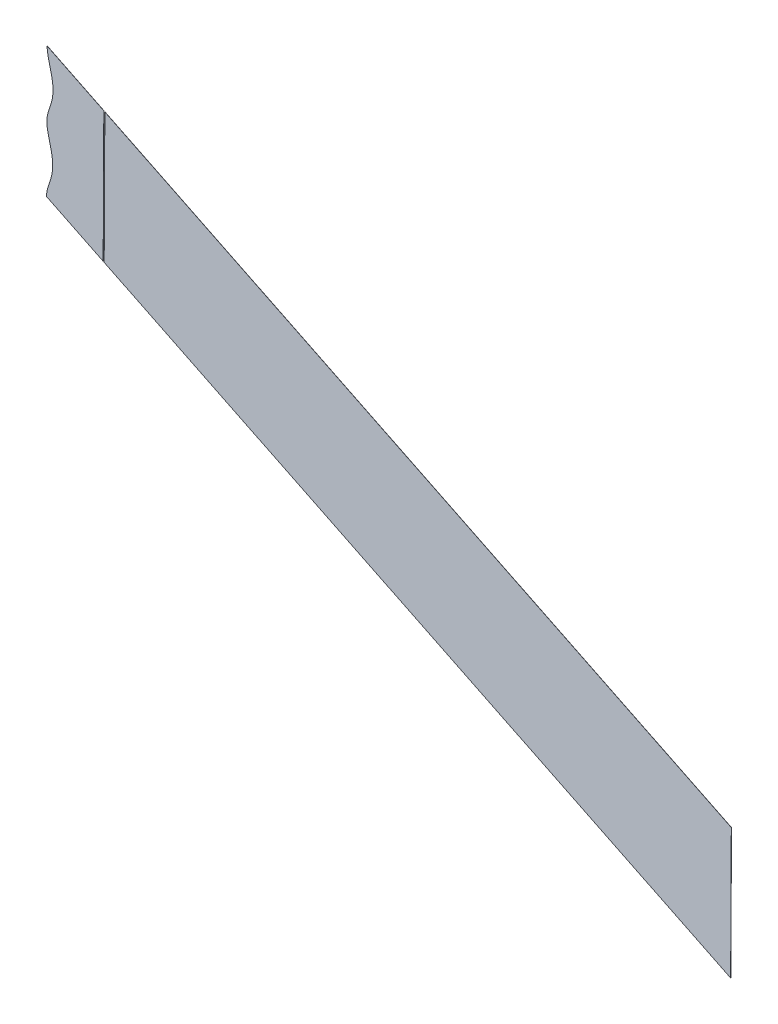
ISO-10303-21;
HEADER;
FILE_DESCRIPTION(('STEP AP214'),'2;1');
FILE_NAME('part.step','',(''),(''),'','','');
FILE_SCHEMA(('AUTOMOTIVE_DESIGN { 1 0 10303 214 1 1 1 1 }'));
ENDSEC;
DATA;
#1=APPLICATION_CONTEXT('core data for automotive mechanical design processes');
#2=APPLICATION_PROTOCOL_DEFINITION('international standard','automotive_design',2000,#1);
#3=PRODUCT_CONTEXT('',#1,'mechanical');
#4=PRODUCT('Part','Part','',(#3));
#5=PRODUCT_RELATED_PRODUCT_CATEGORY('part','',(#4));
#6=PRODUCT_DEFINITION_FORMATION('','',#4);
#7=PRODUCT_DEFINITION_CONTEXT('part definition',#1,'design');
#8=PRODUCT_DEFINITION('design','',#6,#7);
#9=PRODUCT_DEFINITION_SHAPE('','',#8);
#10=(LENGTH_UNIT() NAMED_UNIT(*) SI_UNIT(.MILLI.,.METRE.));
#11=(NAMED_UNIT(*) PLANE_ANGLE_UNIT() SI_UNIT($,.RADIAN.));
#12=(NAMED_UNIT(*) SI_UNIT($,.STERADIAN.) SOLID_ANGLE_UNIT());
#13=UNCERTAINTY_MEASURE_WITH_UNIT(LENGTH_MEASURE(1.E-05),#10,'distance_accuracy_value','');
#14=(GEOMETRIC_REPRESENTATION_CONTEXT(3) GLOBAL_UNCERTAINTY_ASSIGNED_CONTEXT((#13)) GLOBAL_UNIT_ASSIGNED_CONTEXT((#10,
#11,#12)) REPRESENTATION_CONTEXT('',''));
#15=CARTESIAN_POINT('',(0.,0.,0.));
#16=DIRECTION('',(0.,0.,1.));
#17=DIRECTION('',(1.,0.,0.));
#18=AXIS2_PLACEMENT_3D('',#15,#16,#17);
#19=CARTESIAN_POINT('',(628.032804993506,79.4316688549309,219.363239706042));
#20=DIRECTION('',(-0.00123855980853146,-0.999992126449225,0.00377001447705827));
#21=DIRECTION('',(0.,-0.00377001736872001,-0.999992893459268));
#22=AXIS2_PLACEMENT_3D('',#19,#20,#21);
#23=PLANE('',#22);
#24=DIRECTION('',(-0.950043648219437,0.,-0.312117071750175));
#25=VECTOR('',#24,1.);
#26=CARTESIAN_POINT('',(628.032804993506,79.4316688549309,219.363239706042));
#27=LINE('',#26,#25);
#28=CARTESIAN_POINT('',(58.0066160618442,79.4316688549313,32.0929966559377));
#29=VERTEX_POINT('',#28);
#30=CARTESIAN_POINT('',(6.54741442095069,79.4316688549331,15.187146739611));
#31=VERTEX_POINT('',#30);
#32=EDGE_CURVE('E94',#29,#31,#27,.T.);
#33=ORIENTED_EDGE('',*,*,#32,.F.);
#34=DIRECTION('',(-0.312114614280563,0.00396825396825084,0.950036168002534));
#35=VECTOR('',#34,1.);
#36=CARTESIAN_POINT('',(61.1277622046498,79.3919863152488,22.5926349759124));
#37=LINE('',#36,#35);
#38=CARTESIAN_POINT('',(58.0378275232734,79.4312720295342,31.9979930391378));
#39=VERTEX_POINT('',#38);
#40=EDGE_CURVE('E58',#39,#29,#37,.T.);
#41=ORIENTED_EDGE('',*,*,#40,.F.);
#42=DIRECTION('',(-0.950043648219437,0.,-0.312117071750175));
#43=VECTOR('',#42,1.);
#44=CARTESIAN_POINT('',(628.064016454934,79.431272029534,219.268236089242));
#45=LINE('',#44,#43);
#46=CARTESIAN_POINT('',(6.57862588237879,79.4312720295362,15.0921431228107));
#47=VERTEX_POINT('',#46);
#48=EDGE_CURVE('E52',#39,#47,#45,.T.);
#49=ORIENTED_EDGE('',*,*,#48,.T.);
#50=DIRECTION('',(0.312114614280564,-0.00396825396825083,-0.950036168002534));
#51=VECTOR('',#50,1.);
#52=CARTESIAN_POINT('',(6.54741442095069,79.4316688549331,15.187146739611));
#53=LINE('',#52,#51);
#54=EDGE_CURVE('E103',#31,#47,#53,.T.);
#55=ORIENTED_EDGE('',*,*,#54,.F.);
#56=EDGE_LOOP('',(#33,#41,#49,#55));
#57=FACE_BOUND('',#56,.T.);
#58=ADVANCED_FACE('F49',(#57),#23,.F.);
#59=CARTESIAN_POINT('',(627.934485766299,0.0503968253967799,219.662510607126));
#60=DIRECTION('',(-0.00123855980853147,-0.999992126449225,0.00377001447705827));
#61=DIRECTION('',(0.,-0.00377001736872,-0.999992893459268));
#62=AXIS2_PLACEMENT_3D('',#59,#60,#61);
#63=PLANE('',#62);
#64=DIRECTION('',(0.312114614280563,-0.00396825396825083,-0.950036168002534));
#65=VECTOR('',#64,1.);
#66=CARTESIAN_POINT('',(57.9082968346368,0.0503968253967868,32.3922675570206));
#67=LINE('',#66,#65);
#68=CARTESIAN_POINT('',(57.9082968346367,0.0503968253973419,32.3922675570209));
#69=VERTEX_POINT('',#68);
#70=CARTESIAN_POINT('',(57.939508296064,0.0499999999999182,32.2972639402202));
#71=VERTEX_POINT('',#70);
#72=EDGE_CURVE('E77',#69,#71,#67,.T.);
#73=ORIENTED_EDGE('',*,*,#72,.F.);
#74=DIRECTION('',(-0.950043648219437,0.,-0.312117071750175));
#75=VECTOR('',#74,1.);
#76=CARTESIAN_POINT('',(627.934485766299,0.0503968253967799,219.662510607126));
#77=LINE('',#76,#75);
#78=CARTESIAN_POINT('',(6.44909519374426,0.0503968253975917,15.4864176406947));
#79=VERTEX_POINT('',#78);
#80=EDGE_CURVE('E88',#69,#79,#77,.T.);
#81=ORIENTED_EDGE('',*,*,#80,.T.);
#82=DIRECTION('',(0.312114614280564,-0.00396825396825083,-0.950036168002534));
#83=VECTOR('',#82,1.);
#84=CARTESIAN_POINT('',(6.44909519374426,0.0503968253975917,15.4864176406947));
#85=LINE('',#84,#83);
#86=CARTESIAN_POINT('',(6.48030665517235,0.0500000000007716,15.3914140238945));
#87=VERTEX_POINT('',#86);
#88=EDGE_CURVE('E100',#79,#87,#85,.T.);
#89=ORIENTED_EDGE('',*,*,#88,.T.);
#90=DIRECTION('',(-0.950043648219437,0.,-0.312117071750175));
#91=VECTOR('',#90,1.);
#92=CARTESIAN_POINT('',(627.965697227727,0.0499999999999529,219.567506990325));
#93=LINE('',#92,#91);
#94=EDGE_CURVE('E112',#71,#87,#93,.T.);
#95=ORIENTED_EDGE('',*,*,#94,.F.);
#96=EDGE_LOOP('',(#73,#81,#89,#95));
#97=FACE_BOUND('',#96,.T.);
#98=ADVANCED_FACE('F134',(#97),#63,.T.);
#99=CARTESIAN_POINT('',(-6216.50703644315,-6541.54901748097,-2001.61239335012));
#100=DIRECTION('',(-0.312114614280563,0.00396825396825086,0.950036168002534));
#101=DIRECTION('',(0.950043648219437,0.,0.312117071750175));
#102=AXIS2_PLACEMENT_3D('',#99,#100,#101);
#103=PLANE('',#102);
#104=DIRECTION('',(-0.00123855980853318,-0.999992126449225,0.0037700144770577));
#105=VECTOR('',#104,1.);
#106=CARTESIAN_POINT('',(58.0066160618442,79.4316688549313,32.0929966559377));
#107=LINE('',#106,#105);
#108=EDGE_CURVE('E14',#29,#69,#107,.T.);
#109=ORIENTED_EDGE('',*,*,#108,.F.);
#110=ORIENTED_EDGE('',*,*,#32,.T.);
#111=CARTESIAN_POINT('',(6.44909519374426,0.0503968253975917,15.4864176406947));
#112=CARTESIAN_POINT('',(6.45267553206141,0.694877688035618,15.4849019217397));
#113=CARTESIAN_POINT('',(6.60024022614708,1.9723408909303,15.5280453309405));
#114=CARTESIAN_POINT('',(6.87011388118269,3.23074813002961,15.6114504000257));
#115=CARTESIAN_POINT('',(7.23726659138035,4.46588351341087,15.7269116838521));
#116=CARTESIAN_POINT('',(7.66921390288411,5.66719320489578,15.8638011739042));
#117=CARTESIAN_POINT('',(7.9284335005636,6.31243220401629,15.9462672474745));
#118=CARTESIAN_POINT('',(8.13853415182142,6.83540629681218,16.0131070077357));
#119=CARTESIAN_POINT('',(8.42407153259589,7.50652937080194,16.1041111248142));
#120=CARTESIAN_POINT('',(8.57799106491913,7.86829969103337,16.1531670876521));
#121=CARTESIAN_POINT('',(9.26304759597968,9.4531039534343,16.3716085071884));
#122=CARTESIAN_POINT('',(9.44205256667302,9.87519417333377,16.4286538155854));
#123=CARTESIAN_POINT('',(9.71898902647328,10.5282049291955,16.5169079333037));
#124=CARTESIAN_POINT('',(9.93592279887773,11.0670297861327,16.5859263654752));
#125=CARTESIAN_POINT('',(10.192452296035,11.7042033717614,16.6675423513281));
#126=CARTESIAN_POINT('',(10.6360364196736,12.9058616158624,16.808253417977));
#127=CARTESIAN_POINT('',(11.0333203984229,14.1263000971839,16.933675091334));
#128=CARTESIAN_POINT('',(11.5535280437057,16.0329560927653,17.0966144809557));
#129=CARTESIAN_POINT('',(11.9235284408852,18.5707403415976,17.2075702133621));
#130=CARTESIAN_POINT('',(11.92925785254,21.1367631770945,17.1987343421884));
#131=CARTESIAN_POINT('',(11.5691639936483,23.6805202076458,17.0698078508305));
#132=CARTESIAN_POINT('',(11.0534967922278,25.5952291849709,16.8923984775429));
#133=CARTESIAN_POINT('',(10.6573095508077,26.824097076742,16.7571064831371));
#134=CARTESIAN_POINT('',(10.2156455451671,28.0292184592226,16.6069732321367));
#135=CARTESIAN_POINT('',(9.96208485787392,28.6633159174115,16.5210225508718));
#136=CARTESIAN_POINT('',(9.74603608978686,29.2036046197011,16.4477874646219));
#137=CARTESIAN_POINT('',(9.47021850443985,29.8579581546748,16.3544401340031));
#138=CARTESIAN_POINT('',(9.29111869109595,30.282857081357,16.2938258353576));
#139=CARTESIAN_POINT('',(8.60917590746835,31.8695493885859,16.0631601888289));
#140=CARTESIAN_POINT('',(8.45681313155405,32.2297046141754,16.0116002187058));
#141=CARTESIAN_POINT('',(8.17429891387672,32.8975118997124,15.9159966532322));
#142=CARTESIAN_POINT('',(7.96635019813902,33.4179554179033,15.8455055629825));
#143=CARTESIAN_POINT('',(7.70607294634118,34.069364146973,15.7572759858906));
#144=CARTESIAN_POINT('',(7.27475668276162,35.2772033716272,15.6105309179324));
#145=CARTESIAN_POINT('',(6.91128682377729,36.5111062484236,15.4859665078469));
#146=CARTESIAN_POINT('',(6.64303639610869,37.775718600764,15.3925561886019));
#147=CARTESIAN_POINT('',(6.49941091916284,39.0603275080433,15.3400052790538));
#148=CARTESIAN_POINT('',(6.49689689571542,40.3534873472807,15.333777884433));
#149=CARTESIAN_POINT('',(6.63728269784991,41.6406765536393,15.3745221930306));
#150=CARTESIAN_POINT('',(6.90251906480599,42.906314470786,15.4563735754276));
#151=CARTESIAN_POINT('',(7.26613489723288,44.1452542988155,15.5706570006827));
#152=CARTESIAN_POINT('',(7.69631108316671,45.3502898567478,15.7069490615239));
#153=CARTESIAN_POINT('',(7.95466786258342,45.9959341424583,15.7891299812454));
#154=CARTESIAN_POINT('',(8.16494264649847,46.5214195311917,15.8560164596091));
#155=CARTESIAN_POINT('',(8.44915103983868,47.1905713804442,15.946592199228));
#156=CARTESIAN_POINT('',(8.612261692587,47.5746057632301,15.9985747175439));
#157=CARTESIAN_POINT('',(9.29589160006905,49.1559967256257,16.2165617067739));
#158=CARTESIAN_POINT('',(9.46872575901431,49.5629009447927,16.2716431545483));
#159=CARTESIAN_POINT('',(9.74680870427758,50.2175928436464,16.3602669041581));
#160=CARTESIAN_POINT('',(9.96356507603613,50.754345866497,16.4292357089868));
#161=CARTESIAN_POINT('',(10.2214357470817,51.3929100806252,16.5112865010266));
#162=CARTESIAN_POINT('',(10.6673965631501,52.5955831356504,16.6527741417035));
#163=CARTESIAN_POINT('',(11.0672594136796,53.8164618075883,16.7790412110672));
#164=CARTESIAN_POINT('',(11.5923813775179,55.7249177301913,16.9435875795851));
#165=CARTESIAN_POINT('',(11.9691216230043,58.2640703057254,17.0567518334751));
#166=CARTESIAN_POINT('',(11.9817838927626,60.8323424275199,17.050184213412));
#167=CARTESIAN_POINT('',(11.6270393814345,63.3803508577507,16.9229973809996));
#168=CARTESIAN_POINT('',(11.1141723206686,65.297458586134,16.7464979161931));
#169=CARTESIAN_POINT('',(10.7192683987107,66.5281222026935,16.6116200290395));
#170=CARTESIAN_POINT('',(10.2781490420433,67.7355504513362,16.4616560754604));
#171=CARTESIAN_POINT('',(10.0248543775788,68.3702368496085,16.3757903304869));
#172=CARTESIAN_POINT('',(9.80864743092824,68.9119916810477,16.3024971540126));
#173=CARTESIAN_POINT('',(9.53339235459205,69.5656754761143,16.2093374214951));
#174=CARTESIAN_POINT('',(9.35087492870928,69.9991231901554,16.147564629504));
#175=CARTESIAN_POINT('',(8.66516405089601,71.5947010183327,15.9156239396582));
#176=CARTESIAN_POINT('',(8.51857498823377,71.9409094071691,15.8660190581275));
#177=CARTESIAN_POINT('',(8.23517510011873,72.6102323217107,15.7701181933537));
#178=CARTESIAN_POINT('',(8.02725072122673,73.1295895258735,15.6996396359485));
#179=CARTESIAN_POINT('',(7.76633546278482,73.7813082895385,15.6111991600501));
#180=CARTESIAN_POINT('',(7.33320392970049,74.9899674721395,15.4638542981452));
#181=CARTESIAN_POINT('',(6.96739270919833,76.2251137009973,15.3385154890335));
#182=CARTESIAN_POINT('',(6.69638172993881,77.4912336193963,15.2441919509771));
#183=CARTESIAN_POINT('',(6.54941246886365,78.7825820055342,15.1905143602628));
#184=CARTESIAN_POINT('',(6.54741442095069,79.4316688549331,15.187146739611));
#185=B_SPLINE_CURVE_WITH_KNOTS('',2,(#111,#112,#113,#114,#115,#116,#117,#118,#119,#120,#121,
#122,#123,#124,#125,#126,#127,#128,#129,#130,#131,#132,#133,#134,#135,#136,#137,#138,#139,#140,
#141,#142,#143,#144,#145,#146,#147,#148,#149,#150,#151,#152,#153,#154,#155,#156,#157,#158,#159,
#160,#161,#162,#163,#164,#165,#166,#167,#168,#169,#170,#171,#172,#173,#174,#175,#176,#177,#178,
#179,#180,#181,#182,#183,#184),.UNSPECIFIED.,.F.,.F.,(3,1,1,1,1,2,2,1,2,2,1,1,1,1,1,1,1,1,1,2,2,
1,2,2,1,1,1,1,1,1,1,1,1,2,2,1,2,2,1,1,1,1,1,1,1,1,1,2,2,1,2,2,1,1,1,1,3),(0.,0.015625,0.03125,
0.046875,0.0625,0.078125,0.09375,0.109375,0.125,0.140625,0.15625,0.171875,0.1875,0.21875,0.25,
0.28125,0.3125,0.328125,0.34375,0.359375,0.375,0.390625,0.40625,0.421875,0.4375,0.453125,
0.46875,0.484375,0.5,0.515625,0.53125,0.546875,0.5625,0.578125,0.59375,0.609375,0.625,0.640625,
0.65625,0.671875,0.6875,0.71875,0.75,0.78125,0.8125,0.828125,0.84375,0.859375,0.875,0.890625,
0.90625,0.921875,0.9375,0.953125,0.96875,0.984375,1.),.UNSPECIFIED.);
#186=EDGE_CURVE('E98',#79,#31,#185,.T.);
#187=ORIENTED_EDGE('',*,*,#186,.F.);
#188=ORIENTED_EDGE('',*,*,#80,.F.);
#189=EDGE_LOOP('',(#109,#110,#187,#188));
#190=FACE_BOUND('',#189,.T.);
#191=ADVANCED_FACE('F96',(#190),#103,.T.);
#192=CARTESIAN_POINT('',(-6216.47582498172,-6541.54941430637,-2001.70739696692));
#193=DIRECTION('',(-0.312114614280563,0.00396825396825086,0.950036168002534));
#194=DIRECTION('',(0.950043648219437,0.,0.312117071750175));
#195=AXIS2_PLACEMENT_3D('',#192,#193,#194);
#196=PLANE('',#195);
#197=ORIENTED_EDGE('',*,*,#48,.F.);
#198=DIRECTION('',(-0.00123855980853319,-0.999992126449225,0.00377001447705774));
#199=VECTOR('',#198,1.);
#200=CARTESIAN_POINT('',(49.8372823846927,-6541.54941430638,56.9593826137113));
#201=LINE('',#200,#199);
#202=EDGE_CURVE('E73',#39,#71,#201,.T.);
#203=ORIENTED_EDGE('',*,*,#202,.T.);
#204=ORIENTED_EDGE('',*,*,#94,.T.);
#205=CARTESIAN_POINT('',(6.48030665517235,0.0500000000007716,15.3914140238945));
#206=CARTESIAN_POINT('',(6.4838869934894,0.694480862638798,15.3898983049394));
#207=CARTESIAN_POINT('',(6.63145168757517,1.97194406553347,15.4330417141402));
#208=CARTESIAN_POINT('',(6.90132534261073,3.23035130463279,15.5164467832254));
#209=CARTESIAN_POINT('',(7.26847805280839,4.46548668801405,15.6319080670518));
#210=CARTESIAN_POINT('',(7.7004253643122,5.66679637949896,15.7687975571039));
#211=CARTESIAN_POINT('',(7.9596449619917,6.31203537861947,15.8512636306743));
#212=CARTESIAN_POINT('',(8.16974561324946,6.83500947141535,15.9181033909355));
#213=CARTESIAN_POINT('',(8.45528299402387,7.50613254540511,16.0091075080139));
#214=CARTESIAN_POINT('',(8.60920252634717,7.86790286563654,16.0581634708518));
#215=CARTESIAN_POINT('',(9.29425905740772,9.45270712803747,16.2766048903882));
#216=CARTESIAN_POINT('',(9.473264028101,9.87479734793695,16.3336501987851));
#217=CARTESIAN_POINT('',(9.75020048790132,10.5278081037987,16.4219043165034));
#218=CARTESIAN_POINT('',(9.96713426030577,11.0666329607358,16.490922748675));
#219=CARTESIAN_POINT('',(10.2236637574631,11.7038065463646,16.5725387345279));
#220=CARTESIAN_POINT('',(10.6672478811017,12.9054647904656,16.7132498011768));
#221=CARTESIAN_POINT('',(11.064531859851,14.1259032717871,16.8386714745337));
#222=CARTESIAN_POINT('',(11.5847395051338,16.0325592673685,17.0016108641555));
#223=CARTESIAN_POINT('',(11.9547399023133,18.5703435162008,17.1125665965619));
#224=CARTESIAN_POINT('',(11.960469313968,21.1363663516977,17.1037307253882));
#225=CARTESIAN_POINT('',(11.6003754550764,23.680123382249,16.9748042340302));
#226=CARTESIAN_POINT('',(11.0847082536559,25.594832359574,16.7973948607426));
#227=CARTESIAN_POINT('',(10.6885210122358,26.8237002513452,16.6621028663368));
#228=CARTESIAN_POINT('',(10.2468570065952,28.0288216338258,16.5119696153364));
#229=CARTESIAN_POINT('',(9.99329631930202,28.6629190920147,16.4260189340715));
#230=CARTESIAN_POINT('',(9.77724755121495,29.2032077943043,16.3527838478217));
#231=CARTESIAN_POINT('',(9.50142996586784,29.857561329278,16.2594365172028));
#232=CARTESIAN_POINT('',(9.32233015252404,30.2824602559602,16.1988222185573));
#233=CARTESIAN_POINT('',(8.64038736889638,31.8691525631891,15.9681565720286));
#234=CARTESIAN_POINT('',(8.48802459298215,32.2293077887785,15.9165966019056));
#235=CARTESIAN_POINT('',(8.2055103753047,32.8971150743156,15.8209930364319));
#236=CARTESIAN_POINT('',(7.997561659567,33.4175585925065,15.7505019461823));
#237=CARTESIAN_POINT('',(7.73728440776916,34.0689673215762,15.6622723690904));
#238=CARTESIAN_POINT('',(7.30596814418966,35.2768065462303,15.5155273011321));
#239=CARTESIAN_POINT('',(6.94249828520527,36.5107094230268,15.3909628910467));
#240=CARTESIAN_POINT('',(6.67424785753679,37.7753217753671,15.2975525718017));
#241=CARTESIAN_POINT('',(6.53062238059088,39.0599306826465,15.2450016622535));
#242=CARTESIAN_POINT('',(6.52810835714351,40.3530905218838,15.2387742676327));
#243=CARTESIAN_POINT('',(6.66849415927795,41.6402797282425,15.2795185762303));
#244=CARTESIAN_POINT('',(6.93373052623408,42.9059176453892,15.3613699586274));
#245=CARTESIAN_POINT('',(7.29734635866097,44.1448574734187,15.4756533838825));
#246=CARTESIAN_POINT('',(7.72752254459474,45.3498930313509,15.6119454447237));
#247=CARTESIAN_POINT('',(7.98587932401146,45.9955373170615,15.6941263644452));
#248=CARTESIAN_POINT('',(8.19615410792651,46.5210227057948,15.7610128428089));
#249=CARTESIAN_POINT('',(8.48036250126677,47.1901745550474,15.8515885824277));
#250=CARTESIAN_POINT('',(8.64347315401509,47.5742089378333,15.9035711007437));
#251=CARTESIAN_POINT('',(9.32710306149714,49.1555999002289,16.1215580899737));
#252=CARTESIAN_POINT('',(9.4999372204424,49.5625041193959,16.176639537748));
#253=CARTESIAN_POINT('',(9.77802016570561,50.2171960182496,16.2652632873578));
#254=CARTESIAN_POINT('',(9.99477653746411,50.7539490411002,16.3342320921865));
#255=CARTESIAN_POINT('',(10.2526472085097,51.3925132552284,16.4162828842263));
#256=CARTESIAN_POINT('',(10.6986080245782,52.5951863102536,16.5577705249033));
#257=CARTESIAN_POINT('',(11.0984708751077,53.8160649821915,16.684037594267));
#258=CARTESIAN_POINT('',(11.623592838946,55.7245209047945,16.8485839627849));
#259=CARTESIAN_POINT('',(12.0003330844324,58.2636734803286,16.9617482166748));
#260=CARTESIAN_POINT('',(12.0129953541906,60.8319456021231,16.9551805966117));
#261=CARTESIAN_POINT('',(11.6582508428625,63.3799540323539,16.8279937641993));
#262=CARTESIAN_POINT('',(11.1453837820967,65.2970617607371,16.6514942993929));
#263=CARTESIAN_POINT('',(10.7504798601387,66.5277253772967,16.5166164122393));
#264=CARTESIAN_POINT('',(10.3093605034714,67.7351536259394,16.3666524586601));
#265=CARTESIAN_POINT('',(10.0560658390068,68.3698400242116,16.2807867136866));
#266=CARTESIAN_POINT('',(9.83985889235628,68.9115948556509,16.2074935372124));
#267=CARTESIAN_POINT('',(9.5646038160202,69.5652786507175,16.1143338046949));
#268=CARTESIAN_POINT('',(9.38208639013732,69.9987263647586,16.0525610127037));
#269=CARTESIAN_POINT('',(8.69637551232411,71.5943041929359,15.8206203228579));
#270=CARTESIAN_POINT('',(8.54978644966187,71.9405125817723,15.7710154413273));
#271=CARTESIAN_POINT('',(8.26638656154682,72.6098354963138,15.6751145765535));
#272=CARTESIAN_POINT('',(8.05846218265477,73.1291927004767,15.6046360191482));
#273=CARTESIAN_POINT('',(7.79754692421286,73.7809114641417,15.5161955432499));
#274=CARTESIAN_POINT('',(7.36441539112864,74.9895706467427,15.368850681345));
#275=CARTESIAN_POINT('',(6.99860417062642,76.2247168756005,15.2435118722333));
#276=CARTESIAN_POINT('',(6.7275931913669,77.4908367939995,15.1491883341769));
#277=CARTESIAN_POINT('',(6.58062393029174,78.7821851801373,15.0955107434626));
#278=CARTESIAN_POINT('',(6.57862588237879,79.4312720295362,15.0921431228107));
#279=B_SPLINE_CURVE_WITH_KNOTS('',2,(#205,#206,#207,#208,#209,#210,#211,#212,#213,#214,#215,
#216,#217,#218,#219,#220,#221,#222,#223,#224,#225,#226,#227,#228,#229,#230,#231,#232,#233,#234,
#235,#236,#237,#238,#239,#240,#241,#242,#243,#244,#245,#246,#247,#248,#249,#250,#251,#252,#253,
#254,#255,#256,#257,#258,#259,#260,#261,#262,#263,#264,#265,#266,#267,#268,#269,#270,#271,#272,
#273,#274,#275,#276,#277,#278),.UNSPECIFIED.,.F.,.F.,(3,1,1,1,1,2,2,1,2,2,1,1,1,1,1,1,1,1,1,2,2,
1,2,2,1,1,1,1,1,1,1,1,1,2,2,1,2,2,1,1,1,1,1,1,1,1,1,2,2,1,2,2,1,1,1,1,3),(0.,0.015625,0.03125,
0.046875,0.0625,0.078125,0.09375,0.109375,0.125,0.140625,0.15625,0.171875,0.1875,0.21875,0.25,
0.28125,0.3125,0.328125,0.34375,0.359375,0.375,0.390625,0.40625,0.421875,0.4375,0.453125,
0.46875,0.484375,0.5,0.515625,0.53125,0.546875,0.5625,0.578125,0.59375,0.609375,0.625,0.640625,
0.65625,0.671875,0.6875,0.71875,0.75,0.78125,0.8125,0.828125,0.84375,0.859375,0.875,0.890625,
0.90625,0.921875,0.9375,0.953125,0.96875,0.984375,1.),.UNSPECIFIED.);
#280=EDGE_CURVE('E110',#87,#47,#279,.T.);
#281=ORIENTED_EDGE('',*,*,#280,.T.);
#282=EDGE_LOOP('',(#197,#203,#204,#281));
#283=FACE_BOUND('',#282,.T.);
#284=ADVANCED_FACE('F129',(#283),#196,.F.);
#285=DIRECTION('',(0.312114614280564,-0.00396825396825083,-0.950036168002534));
#286=VECTOR('',#285,1.);
#287=SURFACE_OF_LINEAR_EXTRUSION('',#185,#286);
#288=ORIENTED_EDGE('',*,*,#280,.F.);
#289=ORIENTED_EDGE('',*,*,#88,.F.);
#290=ORIENTED_EDGE('',*,*,#186,.T.);
#291=ORIENTED_EDGE('',*,*,#54,.T.);
#292=EDGE_LOOP('',(#288,#289,#290,#291));
#293=FACE_BOUND('',#292,.T.);
#294=ADVANCED_FACE('F109',(#293),#287,.T.);
#295=CARTESIAN_POINT('',(61.1277622046498,79.3919863152488,22.5926349759124));
#296=DIRECTION('',(-0.950043648219437,0.,-0.312117071750175));
#297=DIRECTION('',(-0.312117071750175,0.,0.950043648219436));
#298=AXIS2_PLACEMENT_3D('',#295,#296,#297);
#299=PLANE('',#298);
#300=ORIENTED_EDGE('',*,*,#72,.T.);
#301=ORIENTED_EDGE('',*,*,#202,.F.);
#302=ORIENTED_EDGE('',*,*,#40,.T.);
#303=ORIENTED_EDGE('',*,*,#108,.T.);
#304=EDGE_LOOP('',(#300,#301,#302,#303));
#305=FACE_BOUND('',#304,.T.);
#306=ADVANCED_FACE('F128',(#305),#299,.F.);
#307=CLOSED_SHELL('',(#58,#98,#191,#284,#294,#306));
#308=MANIFOLD_SOLID_BREP('B2',#307);
#309=CARTESIAN_POINT('',(627.934485766299,0.0503968253967799,219.662510607126));
#310=DIRECTION('',(-0.950043648219437,0.,-0.312117071750176));
#311=DIRECTION('',(-0.312117071750176,0.,0.950043648219436));
#312=AXIS2_PLACEMENT_3D('',#309,#310,#311);
#313=PLANE('',#312);
#314=DIRECTION('',(0.0012385598085309,0.999992126449225,-0.0037700144770583));
#315=VECTOR('',#314,1.);
#316=CARTESIAN_POINT('',(627.965697227727,0.0499999999999529,219.567506990325));
#317=LINE('',#316,#315);
#318=CARTESIAN_POINT('',(627.965697227727,0.0499999999999529,219.567506990325));
#319=VERTEX_POINT('',#318);
#320=CARTESIAN_POINT('',(628.064016454934,79.4312720295341,219.268236089242));
#321=VERTEX_POINT('',#320);
#322=EDGE_CURVE('E207',#319,#321,#317,.T.);
#323=ORIENTED_EDGE('',*,*,#322,.T.);
#324=DIRECTION('',(0.312114614280564,-0.00396825396825083,-0.950036168002534));
#325=VECTOR('',#324,1.);
#326=CARTESIAN_POINT('',(628.032804993506,79.4316688549309,219.363239706042));
#327=LINE('',#326,#325);
#328=CARTESIAN_POINT('',(628.032804993506,79.4316688549309,219.363239706042));
#329=VERTEX_POINT('',#328);
#330=EDGE_CURVE('E178',#329,#321,#327,.T.);
#331=ORIENTED_EDGE('',*,*,#330,.F.);
#332=DIRECTION('',(0.0012385598085309,0.999992126449225,-0.0037700144770583));
#333=VECTOR('',#332,1.);
#334=CARTESIAN_POINT('',(627.934485766299,0.0503968253967799,219.662510607126));
#335=LINE('',#334,#333);
#336=CARTESIAN_POINT('',(627.934485766299,0.0503968253967799,219.662510607126));
#337=VERTEX_POINT('',#336);
#338=EDGE_CURVE('E209',#337,#329,#335,.T.);
#339=ORIENTED_EDGE('',*,*,#338,.F.);
#340=DIRECTION('',(0.312114614280564,-0.00396825396825083,-0.950036168002534));
#341=VECTOR('',#340,1.);
#342=CARTESIAN_POINT('',(627.934485766299,0.0503968253967799,219.662510607126));
#343=LINE('',#342,#341);
#344=EDGE_CURVE('E193',#337,#319,#343,.T.);
#345=ORIENTED_EDGE('',*,*,#344,.T.);
#346=EDGE_LOOP('',(#323,#331,#339,#345));
#347=FACE_BOUND('',#346,.T.);
#348=ADVANCED_FACE('F171',(#347),#313,.F.);
#349=CARTESIAN_POINT('',(-6216.50703644315,-6541.54901748097,-2001.61239335012));
#350=DIRECTION('',(-0.312114614280563,0.00396825396825086,0.950036168002534));
#351=DIRECTION('',(0.950043648219437,0.,0.312117071750175));
#352=AXIS2_PLACEMENT_3D('',#349,#350,#351);
#353=PLANE('',#352);
#354=DIRECTION('',(0.00123855980853353,0.999992126449225,-0.00377001447705761));
#355=VECTOR('',#354,1.);
#356=CARTESIAN_POINT('',(58.9566613247582,79.4329725319366,32.405108812768));
#357=LINE('',#356,#355);
#358=CARTESIAN_POINT('',(58.858340482856,0.0503968253975223,32.7043846287711));
#359=VERTEX_POINT('',#358);
#360=CARTESIAN_POINT('',(58.9566597100635,79.4316688549328,32.4051137276878));
#361=VERTEX_POINT('',#360);
#362=EDGE_CURVE('E238',#359,#361,#357,.T.);
#363=ORIENTED_EDGE('',*,*,#362,.F.);
#364=DIRECTION('',(-0.950043648219437,0.,-0.312117071750175));
#365=VECTOR('',#364,1.);
#366=CARTESIAN_POINT('',(627.934485766299,0.0503968253967799,219.662510607126));
#367=LINE('',#366,#365);
#368=EDGE_CURVE('E211',#337,#359,#367,.T.);
#369=ORIENTED_EDGE('',*,*,#368,.F.);
#370=ORIENTED_EDGE('',*,*,#338,.T.);
#371=DIRECTION('',(-0.950043648219437,0.,-0.312117071750175));
#372=VECTOR('',#371,1.);
#373=CARTESIAN_POINT('',(628.032804993506,79.4316688549309,219.363239706042));
#374=LINE('',#373,#372);
#375=EDGE_CURVE('E227',#329,#361,#374,.T.);
#376=ORIENTED_EDGE('',*,*,#375,.T.);
#377=EDGE_LOOP('',(#363,#369,#370,#376));
#378=FACE_BOUND('',#377,.T.);
#379=ADVANCED_FACE('F236',(#378),#353,.T.);
#380=CARTESIAN_POINT('',(-6216.47582498172,-6541.54941430637,-2001.70739696692));
#381=DIRECTION('',(-0.312114614280563,0.00396825396825086,0.950036168002534));
#382=DIRECTION('',(0.950043648219437,0.,0.312117071750175));
#383=AXIS2_PLACEMENT_3D('',#380,#381,#382);
#384=PLANE('',#383);
#385=DIRECTION('',(-0.950043648219437,0.,-0.312117071750175));
#386=VECTOR('',#385,1.);
#387=CARTESIAN_POINT('',(627.965697227727,0.0499999999999529,219.567506990325));
#388=LINE('',#387,#386);
#389=CARTESIAN_POINT('',(58.8895519442853,0.0500000000006467,32.6093810119713));
#390=VERTEX_POINT('',#389);
#391=EDGE_CURVE('E217',#319,#390,#388,.T.);
#392=ORIENTED_EDGE('',*,*,#391,.T.);
#393=DIRECTION('',(0.00123855980853353,0.999992126449225,-0.00377001447705763));
#394=VECTOR('',#393,1.);
#395=CARTESIAN_POINT('',(50.7873260329088,-6541.54941430638,57.2714996854606));
#396=LINE('',#395,#394);
#397=CARTESIAN_POINT('',(58.9878711714899,79.4312720295342,32.3101101108869));
#398=VERTEX_POINT('',#397);
#399=EDGE_CURVE('E47',#390,#398,#396,.T.);
#400=ORIENTED_EDGE('',*,*,#399,.T.);
#401=DIRECTION('',(-0.950043648219437,0.,-0.312117071750175));
#402=VECTOR('',#401,1.);
#403=CARTESIAN_POINT('',(628.064016454934,79.431272029534,219.268236089242));
#404=LINE('',#403,#402);
#405=EDGE_CURVE('E219',#321,#398,#404,.T.);
#406=ORIENTED_EDGE('',*,*,#405,.F.);
#407=ORIENTED_EDGE('',*,*,#322,.F.);
#408=EDGE_LOOP('',(#392,#400,#406,#407));
#409=FACE_BOUND('',#408,.T.);
#410=ADVANCED_FACE('F215',(#409),#384,.F.);
#411=CARTESIAN_POINT('',(627.934485766299,0.0503968253967799,219.662510607126));
#412=DIRECTION('',(-0.00123855980853147,-0.999992126449225,0.00377001447705827));
#413=DIRECTION('',(0.,-0.00377001736872,-0.999992893459268));
#414=AXIS2_PLACEMENT_3D('',#411,#412,#413);
#415=PLANE('',#414);
#416=DIRECTION('',(-0.312114614280563,0.00396825396825084,0.950036168002534));
#417=VECTOR('',#416,1.);
#418=CARTESIAN_POINT('',(61.9794866256617,0.010714285715023,23.2040229487457));
#419=LINE('',#418,#417);
#420=EDGE_CURVE('E225',#390,#359,#419,.T.);
#421=ORIENTED_EDGE('',*,*,#420,.F.);
#422=ORIENTED_EDGE('',*,*,#391,.F.);
#423=ORIENTED_EDGE('',*,*,#344,.F.);
#424=ORIENTED_EDGE('',*,*,#368,.T.);
#425=EDGE_LOOP('',(#421,#422,#423,#424));
#426=FACE_BOUND('',#425,.T.);
#427=ADVANCED_FACE('F223',(#426),#415,.T.);
#428=CARTESIAN_POINT('',(628.032804993506,79.4316688549309,219.363239706042));
#429=DIRECTION('',(-0.00123855980853146,-0.999992126449225,0.00377001447705827));
#430=DIRECTION('',(0.,-0.00377001736872001,-0.999992893459268));
#431=AXIS2_PLACEMENT_3D('',#428,#429,#430);
#432=PLANE('',#431);
#433=ORIENTED_EDGE('',*,*,#405,.T.);
#434=DIRECTION('',(-0.312114614280563,0.00396825396825083,0.950036168002534));
#435=VECTOR('',#434,1.);
#436=CARTESIAN_POINT('',(58.9566597100635,79.4316688549309,32.4051137276875));
#437=LINE('',#436,#435);
#438=EDGE_CURVE('E185',#398,#361,#437,.T.);
#439=ORIENTED_EDGE('',*,*,#438,.T.);
#440=ORIENTED_EDGE('',*,*,#375,.F.);
#441=ORIENTED_EDGE('',*,*,#330,.T.);
#442=EDGE_LOOP('',(#433,#439,#440,#441));
#443=FACE_BOUND('',#442,.T.);
#444=ADVANCED_FACE('F231',(#443),#432,.F.);
#445=CARTESIAN_POINT('',(62.0778074675638,79.3932899922541,22.9047471327426));
#446=DIRECTION('',(0.950043648219437,0.,0.312117071750175));
#447=DIRECTION('',(0.312117071750175,0.,-0.950043648219436));
#448=AXIS2_PLACEMENT_3D('',#445,#446,#447);
#449=PLANE('',#448);
#450=ORIENTED_EDGE('',*,*,#399,.F.);
#451=ORIENTED_EDGE('',*,*,#420,.T.);
#452=ORIENTED_EDGE('',*,*,#362,.T.);
#453=ORIENTED_EDGE('',*,*,#438,.F.);
#454=EDGE_LOOP('',(#450,#451,#452,#453));
#455=FACE_BOUND('',#454,.T.);
#456=ADVANCED_FACE('F243',(#455),#449,.F.);
#457=CLOSED_SHELL('',(#348,#379,#410,#427,#444,#456));
#458=MANIFOLD_SOLID_BREP('B8',#457);
#459=ADVANCED_BREP_SHAPE_REPRESENTATION('',(#18,#308,#458),#14);
#460=SHAPE_DEFINITION_REPRESENTATION(#9,#459);
ENDSEC;
END-ISO-10303-21;
